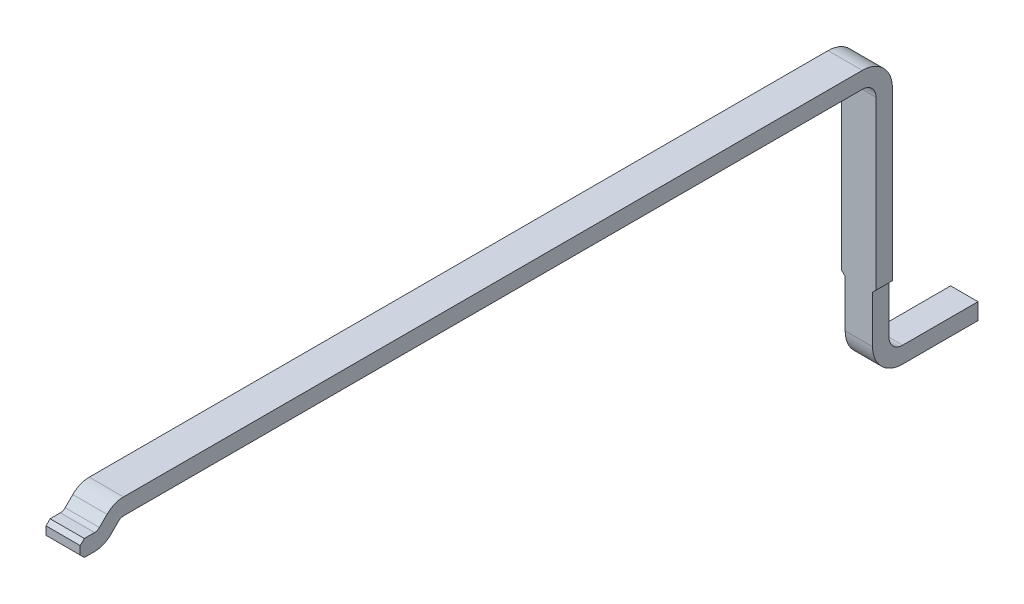
ISO-10303-21;
HEADER;
FILE_DESCRIPTION(('STEP AP214'),'2;1');
FILE_NAME('part.step','',(''),(''),'','','');
FILE_SCHEMA(('AUTOMOTIVE_DESIGN { 1 0 10303 214 1 1 1 1 }'));
ENDSEC;
DATA;
#1=APPLICATION_CONTEXT('core data for automotive mechanical design processes');
#2=APPLICATION_PROTOCOL_DEFINITION('international standard','automotive_design',2000,#1);
#3=PRODUCT_CONTEXT('',#1,'mechanical');
#4=PRODUCT('Part','Part','',(#3));
#5=PRODUCT_RELATED_PRODUCT_CATEGORY('part','',(#4));
#6=PRODUCT_DEFINITION_FORMATION('','',#4);
#7=PRODUCT_DEFINITION_CONTEXT('part definition',#1,'design');
#8=PRODUCT_DEFINITION('design','',#6,#7);
#9=PRODUCT_DEFINITION_SHAPE('','',#8);
#10=(LENGTH_UNIT() NAMED_UNIT(*) SI_UNIT(.MILLI.,.METRE.));
#11=(NAMED_UNIT(*) PLANE_ANGLE_UNIT() SI_UNIT($,.RADIAN.));
#12=(NAMED_UNIT(*) SI_UNIT($,.STERADIAN.) SOLID_ANGLE_UNIT());
#13=UNCERTAINTY_MEASURE_WITH_UNIT(LENGTH_MEASURE(1.E-05),#10,'distance_accuracy_value','');
#14=(GEOMETRIC_REPRESENTATION_CONTEXT(3) GLOBAL_UNCERTAINTY_ASSIGNED_CONTEXT((#13)) GLOBAL_UNIT_ASSIGNED_CONTEXT((#10,
#11,#12)) REPRESENTATION_CONTEXT('',''));
#15=CARTESIAN_POINT('',(0.,0.,0.));
#16=DIRECTION('',(0.,0.,1.));
#17=DIRECTION('',(1.,0.,0.));
#18=AXIS2_PLACEMENT_3D('',#15,#16,#17);
#19=CARTESIAN_POINT('',(12.5121082047,13.39951558355,-11.38169883308));
#20=DIRECTION('',(0.,1.,0.));
#21=DIRECTION('',(1.,0.,0.));
#22=AXIS2_PLACEMENT_3D('',#19,#20,#21);
#23=PLANE('',#22);
#24=DIRECTION('',(0.,0.,-1.));
#25=VECTOR('',#24,1.);
#26=CARTESIAN_POINT('',(15.91210822402,13.39951558355,-12.98169883308));
#27=LINE('',#26,#25);
#28=CARTESIAN_POINT('',(15.91210822402,13.39951558355,-5.777115138679));
#29=VERTEX_POINT('',#28);
#30=CARTESIAN_POINT('',(15.91210822402,13.39951558355,-11.17169883308));
#31=VERTEX_POINT('',#30);
#32=EDGE_CURVE('E422',#29,#31,#27,.T.);
#33=ORIENTED_EDGE('',*,*,#32,.F.);
#34=DIRECTION('',(1.,0.,0.));
#35=VECTOR('',#34,1.);
#36=CARTESIAN_POINT('',(12.5121082047,13.39951558355,-5.777115138679));
#37=LINE('',#36,#35);
#38=CARTESIAN_POINT('',(15.66210822402,13.39951558355,-5.777115138679));
#39=VERTEX_POINT('',#38);
#40=EDGE_CURVE('E316',#39,#29,#37,.T.);
#41=ORIENTED_EDGE('',*,*,#40,.F.);
#42=DIRECTION('',(0.,0.,1.));
#43=VECTOR('',#42,1.);
#44=CARTESIAN_POINT('',(15.66210822402,13.39951558355,-5.731698833076));
#45=LINE('',#44,#43);
#46=CARTESIAN_POINT('',(15.66210822402,13.39951558355,-11.17169883308));
#47=VERTEX_POINT('',#46);
#48=EDGE_CURVE('E288',#47,#39,#45,.T.);
#49=ORIENTED_EDGE('',*,*,#48,.F.);
#50=DIRECTION('',(1.,0.,0.));
#51=VECTOR('',#50,1.);
#52=CARTESIAN_POINT('',(13.11210817501,13.39951558355,-11.17169883308));
#53=LINE('',#52,#51);
#54=EDGE_CURVE('E319',#47,#31,#53,.T.);
#55=ORIENTED_EDGE('',*,*,#54,.T.);
#56=EDGE_LOOP('',(#33,#41,#49,#55));
#57=FACE_BOUND('',#56,.T.);
#58=ADVANCED_FACE('F17',(#57),#23,.F.);
#59=CARTESIAN_POINT('',(13.0621082047,13.51951558355,-7.369063364689));
#60=DIRECTION('',(0.,1.,0.));
#61=DIRECTION('',(1.,0.,0.));
#62=AXIS2_PLACEMENT_3D('',#59,#60,#61);
#63=PLANE('',#62);
#64=DIRECTION('',(-1.,0.,0.));
#65=VECTOR('',#64,1.);
#66=CARTESIAN_POINT('',(13.0621082047,13.51951558355,-11.17169883308));
#67=LINE('',#66,#65);
#68=CARTESIAN_POINT('',(15.91210822402,13.51951558355,-11.17169883308));
#69=VERTEX_POINT('',#68);
#70=CARTESIAN_POINT('',(15.66210822402,13.51951558355,-11.17169883308));
#71=VERTEX_POINT('',#70);
#72=EDGE_CURVE('E28',#69,#71,#67,.T.);
#73=ORIENTED_EDGE('',*,*,#72,.T.);
#74=DIRECTION('',(0.,0.,1.));
#75=VECTOR('',#74,1.);
#76=CARTESIAN_POINT('',(15.66210822402,13.51951558355,-7.369063364689));
#77=LINE('',#76,#75);
#78=CARTESIAN_POINT('',(15.66210822402,13.51951558355,-5.777115138679));
#79=VERTEX_POINT('',#78);
#80=EDGE_CURVE('E302',#71,#79,#77,.T.);
#81=ORIENTED_EDGE('',*,*,#80,.T.);
#82=DIRECTION('',(1.,0.,0.));
#83=VECTOR('',#82,1.);
#84=CARTESIAN_POINT('',(13.0621082047,13.51951558355,-5.777115138679));
#85=LINE('',#84,#83);
#86=CARTESIAN_POINT('',(15.91210822402,13.51951558355,-5.777115138679));
#87=VERTEX_POINT('',#86);
#88=EDGE_CURVE('E11',#79,#87,#85,.T.);
#89=ORIENTED_EDGE('',*,*,#88,.T.);
#90=DIRECTION('',(0.,0.,-1.));
#91=VECTOR('',#90,1.);
#92=CARTESIAN_POINT('',(15.91210822402,13.51951558355,-7.369063364689));
#93=LINE('',#92,#91);
#94=EDGE_CURVE('E325',#87,#69,#93,.T.);
#95=ORIENTED_EDGE('',*,*,#94,.T.);
#96=EDGE_LOOP('',(#73,#81,#89,#95));
#97=FACE_BOUND('',#96,.T.);
#98=ADVANCED_FACE('F584',(#97),#63,.T.);
#99=CARTESIAN_POINT('',(13.0621082047,13.34951558355,-5.777115138679));
#100=DIRECTION('',(-1.,0.,0.));
#101=DIRECTION('',(0.,0.,-1.));
#102=AXIS2_PLACEMENT_3D('',#99,#100,#101);
#103=CYLINDRICAL_SURFACE('',#102,0.17);
#104=ORIENTED_EDGE('',*,*,#88,.F.);
#105=CARTESIAN_POINT('',(15.66210822402,13.34951558355,-5.777115138679));
#106=DIRECTION('',(1.,0.,0.));
#107=DIRECTION('',(0.,0.,-1.));
#108=AXIS2_PLACEMENT_3D('',#105,#106,#107);
#109=CIRCLE('',#108,0.17);
#110=CARTESIAN_POINT('',(15.66210822402,13.469723736351,-5.656906985878));
#111=VERTEX_POINT('',#110);
#112=EDGE_CURVE('E298',#79,#111,#109,.T.);
#113=ORIENTED_EDGE('',*,*,#112,.T.);
#114=DIRECTION('',(1.,0.,0.));
#115=VECTOR('',#114,1.);
#116=CARTESIAN_POINT('',(13.0621082047,13.469723736351,-5.656906985877));
#117=LINE('',#116,#115);
#118=CARTESIAN_POINT('',(15.91210822402,13.469723736351,-5.656906985878));
#119=VERTEX_POINT('',#118);
#120=EDGE_CURVE('E359',#111,#119,#117,.T.);
#121=ORIENTED_EDGE('',*,*,#120,.T.);
#122=CARTESIAN_POINT('',(15.91210822402,13.34951558355,-5.777115138679));
#123=DIRECTION('',(1.,0.,0.));
#124=DIRECTION('',(0.,0.,-1.));
#125=AXIS2_PLACEMENT_3D('',#122,#123,#124);
#126=CIRCLE('',#125,0.17);
#127=EDGE_CURVE('E320',#87,#119,#126,.T.);
#128=ORIENTED_EDGE('',*,*,#127,.F.);
#129=EDGE_LOOP('',(#104,#113,#121,#128));
#130=FACE_BOUND('',#129,.T.);
#131=ADVANCED_FACE('F591',(#130),#103,.T.);
#132=CARTESIAN_POINT('',(13.1121082047,13.29951558355,-11.17169883308));
#133=DIRECTION('',(1.,0.,0.));
#134=DIRECTION('',(0.,0.,1.));
#135=AXIS2_PLACEMENT_3D('',#132,#133,#134);
#136=CYLINDRICAL_SURFACE('',#135,0.22);
#137=ORIENTED_EDGE('',*,*,#72,.F.);
#138=CARTESIAN_POINT('',(15.91210822402,13.29951558355,-11.17169883308));
#139=DIRECTION('',(-1.,0.,0.));
#140=DIRECTION('',(0.,0.,1.));
#141=AXIS2_PLACEMENT_3D('',#138,#139,#140);
#142=CIRCLE('',#141,0.22);
#143=CARTESIAN_POINT('',(15.91210822402,13.29951558355,-11.39169883308));
#144=VERTEX_POINT('',#143);
#145=EDGE_CURVE('E392',#69,#144,#142,.T.);
#146=ORIENTED_EDGE('',*,*,#145,.T.);
#147=DIRECTION('',(-1.,0.,0.));
#148=VECTOR('',#147,1.);
#149=CARTESIAN_POINT('',(13.1121082047,13.29951558355,-11.39169883308));
#150=LINE('',#149,#148);
#151=CARTESIAN_POINT('',(15.66210822402,13.29951558355,-11.39169883308));
#152=VERTEX_POINT('',#151);
#153=EDGE_CURVE('E358',#144,#152,#150,.T.);
#154=ORIENTED_EDGE('',*,*,#153,.T.);
#155=CARTESIAN_POINT('',(15.66210822402,13.29951558355,-11.17169883308));
#156=DIRECTION('',(1.,0.,0.));
#157=DIRECTION('',(0.,0.,1.));
#158=AXIS2_PLACEMENT_3D('',#155,#156,#157);
#159=CIRCLE('',#158,0.22);
#160=EDGE_CURVE('E508',#152,#71,#159,.T.);
#161=ORIENTED_EDGE('',*,*,#160,.T.);
#162=EDGE_LOOP('',(#137,#146,#154,#161));
#163=FACE_BOUND('',#162,.T.);
#164=ADVANCED_FACE('F596',(#163),#136,.T.);
#165=CARTESIAN_POINT('',(16.91210823377,13.39951558355,-5.586698833076));
#166=DIRECTION('',(0.,0.707106781186048,0.707106781187048));
#167=DIRECTION('',(1.,0.,0.));
#168=AXIS2_PLACEMENT_3D('',#165,#166,#167);
#169=PLANE('',#168);
#170=DIRECTION('',(1.,0.,0.));
#171=VECTOR('',#170,1.);
#172=CARTESIAN_POINT('',(16.91210823377,13.414160244491,-5.601343494016));
#173=LINE('',#172,#171);
#174=CARTESIAN_POINT('',(15.66210822402,13.41416024449,-5.601343494017));
#175=VERTEX_POINT('',#174);
#176=CARTESIAN_POINT('',(15.91210822402,13.41416024449,-5.601343494017));
#177=VERTEX_POINT('',#176);
#178=EDGE_CURVE('E178',#175,#177,#173,.T.);
#179=ORIENTED_EDGE('',*,*,#178,.T.);
#180=DIRECTION('',(0.,-0.707106781180048,0.707106781193047));
#181=VECTOR('',#180,1.);
#182=CARTESIAN_POINT('',(15.91210822402,13.46972373635,-5.656906985878));
#183=LINE('',#182,#181);
#184=EDGE_CURVE('E324',#119,#177,#183,.T.);
#185=ORIENTED_EDGE('',*,*,#184,.F.);
#186=ORIENTED_EDGE('',*,*,#120,.F.);
#187=DIRECTION('',(0.,-0.707106781180048,0.707106781193047));
#188=VECTOR('',#187,1.);
#189=CARTESIAN_POINT('',(15.66210822402,13.46972373635,-5.656906985878));
#190=LINE('',#189,#188);
#191=EDGE_CURVE('E303',#111,#175,#190,.T.);
#192=ORIENTED_EDGE('',*,*,#191,.T.);
#193=EDGE_LOOP('',(#179,#185,#186,#192));
#194=FACE_BOUND('',#193,.T.);
#195=ADVANCED_FACE('F640',(#194),#169,.T.);
#196=CARTESIAN_POINT('',(16.91210823377,13.44951558355,-5.565988154957));
#197=DIRECTION('',(-1.,0.,0.));
#198=DIRECTION('',(0.,0.,-1.));
#199=AXIS2_PLACEMENT_3D('',#196,#197,#198);
#200=CYLINDRICAL_SURFACE('',#199,0.05);
#201=DIRECTION('',(1.,0.,0.));
#202=VECTOR('',#201,1.);
#203=CARTESIAN_POINT('',(17.56534248199,13.39951558355,-5.565988154957));
#204=LINE('',#203,#202);
#205=CARTESIAN_POINT('',(15.66210822402,13.39951558355,-5.565988154957));
#206=VERTEX_POINT('',#205);
#207=CARTESIAN_POINT('',(15.91210822402,13.39951558355,-5.565988154957));
#208=VERTEX_POINT('',#207);
#209=EDGE_CURVE('E165',#206,#208,#204,.T.);
#210=ORIENTED_EDGE('',*,*,#209,.T.);
#211=CARTESIAN_POINT('',(15.91210822402,13.44951558355,-5.565988154957));
#212=DIRECTION('',(-1.,0.,0.));
#213=DIRECTION('',(0.,0.,-1.));
#214=AXIS2_PLACEMENT_3D('',#211,#212,#213);
#215=CIRCLE('',#214,0.05);
#216=EDGE_CURVE('E388',#177,#208,#215,.T.);
#217=ORIENTED_EDGE('',*,*,#216,.F.);
#218=ORIENTED_EDGE('',*,*,#178,.F.);
#219=CARTESIAN_POINT('',(15.66210822402,13.44951558355,-5.565988154957));
#220=DIRECTION('',(-1.,0.,0.));
#221=DIRECTION('',(0.,0.,-1.));
#222=AXIS2_PLACEMENT_3D('',#219,#220,#221);
#223=CIRCLE('',#222,0.05);
#224=EDGE_CURVE('E314',#175,#206,#223,.T.);
#225=ORIENTED_EDGE('',*,*,#224,.T.);
#226=EDGE_LOOP('',(#210,#217,#218,#225));
#227=FACE_BOUND('',#226,.T.);
#228=ADVANCED_FACE('F638',(#227),#200,.F.);
#229=CARTESIAN_POINT('',(17.56534248199,13.39951558355,-5.535988154957));
#230=DIRECTION('',(0.,-1.,-1.402976681707E-13));
#231=DIRECTION('',(0.,1.402976681707E-13,-1.));
#232=AXIS2_PLACEMENT_3D('',#229,#230,#231);
#233=PLANE('',#232);
#234=DIRECTION('',(0.,0.,1.));
#235=VECTOR('',#234,1.);
#236=CARTESIAN_POINT('',(15.91210822402,13.39951558355,-12.98169883308));
#237=LINE('',#236,#235);
#238=CARTESIAN_POINT('',(15.91210822402,13.39951558355,-5.491404460561));
#239=VERTEX_POINT('',#238);
#240=EDGE_CURVE('E384',#208,#239,#237,.T.);
#241=ORIENTED_EDGE('',*,*,#240,.F.);
#242=ORIENTED_EDGE('',*,*,#209,.F.);
#243=DIRECTION('',(0.,0.,1.));
#244=VECTOR('',#243,1.);
#245=CARTESIAN_POINT('',(15.66210822402,13.39951558355,-5.731698833076));
#246=LINE('',#245,#244);
#247=CARTESIAN_POINT('',(15.66210822402,13.39951558355,-5.491404460561));
#248=VERTEX_POINT('',#247);
#249=EDGE_CURVE('E310',#206,#248,#246,.T.);
#250=ORIENTED_EDGE('',*,*,#249,.T.);
#251=DIRECTION('',(-1.,0.,0.));
#252=VECTOR('',#251,1.);
#253=CARTESIAN_POINT('',(16.91210823377,13.39951558355,-5.491404460561));
#254=LINE('',#253,#252);
#255=EDGE_CURVE('E326',#239,#248,#254,.T.);
#256=ORIENTED_EDGE('',*,*,#255,.F.);
#257=EDGE_LOOP('',(#241,#242,#250,#256));
#258=FACE_BOUND('',#257,.T.);
#259=ADVANCED_FACE('F635',(#258),#233,.F.);
#260=CARTESIAN_POINT('',(16.91210823377,13.36951558355,-5.461404460561));
#261=DIRECTION('',(0.,0.707106781186048,0.707106781187048));
#262=DIRECTION('',(1.,0.,0.));
#263=AXIS2_PLACEMENT_3D('',#260,#261,#262);
#264=PLANE('',#263);
#265=DIRECTION('',(-1.,0.,0.));
#266=VECTOR('',#265,1.);
#267=CARTESIAN_POINT('',(16.91210823377,13.36951558355,-5.461404460561));
#268=LINE('',#267,#266);
#269=CARTESIAN_POINT('',(15.91210822402,13.36951558355,-5.461404460561));
#270=VERTEX_POINT('',#269);
#271=CARTESIAN_POINT('',(15.66210822402,13.36951558355,-5.461404460561));
#272=VERTEX_POINT('',#271);
#273=EDGE_CURVE('E329',#270,#272,#268,.T.);
#274=ORIENTED_EDGE('',*,*,#273,.F.);
#275=DIRECTION('',(0.,-0.707106781186548,0.707106781186548));
#276=VECTOR('',#275,1.);
#277=CARTESIAN_POINT('',(15.91210822402,13.39951558355,-5.491404460561));
#278=LINE('',#277,#276);
#279=EDGE_CURVE('E353',#239,#270,#278,.T.);
#280=ORIENTED_EDGE('',*,*,#279,.F.);
#281=ORIENTED_EDGE('',*,*,#255,.T.);
#282=DIRECTION('',(0.,-0.707106781186548,0.707106781186548));
#283=VECTOR('',#282,1.);
#284=CARTESIAN_POINT('',(15.66210822402,13.39951558355,-5.491404460561));
#285=LINE('',#284,#283);
#286=EDGE_CURVE('E315',#248,#272,#285,.T.);
#287=ORIENTED_EDGE('',*,*,#286,.T.);
#288=EDGE_LOOP('',(#274,#280,#281,#287));
#289=FACE_BOUND('',#288,.T.);
#290=ADVANCED_FACE('F623',(#289),#264,.T.);
#291=CARTESIAN_POINT('',(16.91210823377,13.27951558355,-5.461404460561));
#292=DIRECTION('',(0.,0.,1.));
#293=DIRECTION('',(1.,0.,0.));
#294=AXIS2_PLACEMENT_3D('',#291,#292,#293);
#295=PLANE('',#294);
#296=DIRECTION('',(1.,0.,0.));
#297=VECTOR('',#296,1.);
#298=CARTESIAN_POINT('',(16.91210823377,13.30951558355,-5.461404460561));
#299=LINE('',#298,#297);
#300=CARTESIAN_POINT('',(15.66210822402,13.30951558355,-5.461404460561));
#301=VERTEX_POINT('',#300);
#302=CARTESIAN_POINT('',(15.91210822402,13.30951558355,-5.461404460561));
#303=VERTEX_POINT('',#302);
#304=EDGE_CURVE('E464',#301,#303,#299,.T.);
#305=ORIENTED_EDGE('',*,*,#304,.T.);
#306=DIRECTION('',(0.,-1.,0.));
#307=VECTOR('',#306,1.);
#308=CARTESIAN_POINT('',(15.91210822402,13.67951558355,-5.461404460561));
#309=LINE('',#308,#307);
#310=EDGE_CURVE('E348',#270,#303,#309,.T.);
#311=ORIENTED_EDGE('',*,*,#310,.F.);
#312=ORIENTED_EDGE('',*,*,#273,.T.);
#313=DIRECTION('',(0.,-1.,0.));
#314=VECTOR('',#313,1.);
#315=CARTESIAN_POINT('',(15.66210822402,13.39951558355,-5.461404460561));
#316=LINE('',#315,#314);
#317=EDGE_CURVE('E339',#272,#301,#316,.T.);
#318=ORIENTED_EDGE('',*,*,#317,.T.);
#319=EDGE_LOOP('',(#305,#311,#312,#318));
#320=FACE_BOUND('',#319,.T.);
#321=ADVANCED_FACE('F602',(#320),#295,.T.);
#322=CARTESIAN_POINT('',(16.91210823377,13.27951558355,-5.491404460561));
#323=DIRECTION('',(0.,0.707106781186048,-0.707106781187048));
#324=DIRECTION('',(-1.,0.,0.));
#325=AXIS2_PLACEMENT_3D('',#322,#323,#324);
#326=PLANE('',#325);
#327=DIRECTION('',(-1.,0.,0.));
#328=VECTOR('',#327,1.);
#329=CARTESIAN_POINT('',(16.91210823377,13.27951558355,-5.491404460561));
#330=LINE('',#329,#328);
#331=CARTESIAN_POINT('',(15.91210822402,13.27951558355,-5.491404460561));
#332=VERTEX_POINT('',#331);
#333=CARTESIAN_POINT('',(15.66210822402,13.27951558355,-5.491404460561));
#334=VERTEX_POINT('',#333);
#335=EDGE_CURVE('E458',#332,#334,#330,.T.);
#336=ORIENTED_EDGE('',*,*,#335,.F.);
#337=DIRECTION('',(0.,-0.707106781186548,-0.707106781186548));
#338=VECTOR('',#337,1.);
#339=CARTESIAN_POINT('',(15.91210822402,13.30951558355,-5.461404460561));
#340=LINE('',#339,#338);
#341=EDGE_CURVE('E352',#303,#332,#340,.T.);
#342=ORIENTED_EDGE('',*,*,#341,.F.);
#343=ORIENTED_EDGE('',*,*,#304,.F.);
#344=DIRECTION('',(0.,-0.707106781186548,-0.707106781186548));
#345=VECTOR('',#344,1.);
#346=CARTESIAN_POINT('',(15.66210822402,13.30951558355,-5.461404460561));
#347=LINE('',#346,#345);
#348=EDGE_CURVE('E335',#301,#334,#347,.T.);
#349=ORIENTED_EDGE('',*,*,#348,.T.);
#350=EDGE_LOOP('',(#336,#342,#343,#349));
#351=FACE_BOUND('',#350,.T.);
#352=ADVANCED_FACE('F598',(#351),#326,.F.);
#353=CARTESIAN_POINT('',(16.91210823377,13.27951558355,-5.661404460561));
#354=DIRECTION('',(0.,-1.,0.));
#355=DIRECTION('',(0.,0.,-1.));
#356=AXIS2_PLACEMENT_3D('',#353,#354,#355);
#357=PLANE('',#356);
#358=ORIENTED_EDGE('',*,*,#335,.T.);
#359=DIRECTION('',(0.,0.,-1.));
#360=VECTOR('',#359,1.);
#361=CARTESIAN_POINT('',(15.66210822402,13.27951558355,-5.731698833076));
#362=LINE('',#361,#360);
#363=CARTESIAN_POINT('',(15.66210822402,13.27951558355,-5.565988154957));
#364=VERTEX_POINT('',#363);
#365=EDGE_CURVE('E276',#334,#364,#362,.T.);
#366=ORIENTED_EDGE('',*,*,#365,.T.);
#367=DIRECTION('',(-1.,0.,0.));
#368=VECTOR('',#367,1.);
#369=CARTESIAN_POINT('',(16.91210823377,13.27951558355,-5.565988154957));
#370=LINE('',#369,#368);
#371=CARTESIAN_POINT('',(15.91210822402,13.27951558355,-5.565988154957));
#372=VERTEX_POINT('',#371);
#373=EDGE_CURVE('E266',#372,#364,#370,.T.);
#374=ORIENTED_EDGE('',*,*,#373,.F.);
#375=DIRECTION('',(0.,0.,-1.));
#376=VECTOR('',#375,1.);
#377=CARTESIAN_POINT('',(15.91210822402,13.27951558355,-12.98169883308));
#378=LINE('',#377,#376);
#379=EDGE_CURVE('E401',#332,#372,#378,.T.);
#380=ORIENTED_EDGE('',*,*,#379,.F.);
#381=EDGE_LOOP('',(#358,#366,#374,#380));
#382=FACE_BOUND('',#381,.T.);
#383=ADVANCED_FACE('F601',(#382),#357,.T.);
#384=CARTESIAN_POINT('',(16.91210823377,13.44951558355,-5.565988154957));
#385=DIRECTION('',(1.,0.,0.));
#386=DIRECTION('',(0.,0.,1.));
#387=AXIS2_PLACEMENT_3D('',#384,#385,#386);
#388=CYLINDRICAL_SURFACE('',#387,0.17);
#389=DIRECTION('',(-1.,0.,0.));
#390=VECTOR('',#389,1.);
#391=CARTESIAN_POINT('',(16.91210823377,13.329307430749,-5.68619630776));
#392=LINE('',#391,#390);
#393=CARTESIAN_POINT('',(15.91210822402,13.329307430749,-5.686196307759));
#394=VERTEX_POINT('',#393);
#395=CARTESIAN_POINT('',(15.66210822402,13.329307430749,-5.686196307759));
#396=VERTEX_POINT('',#395);
#397=EDGE_CURVE('E254',#394,#396,#392,.T.);
#398=ORIENTED_EDGE('',*,*,#397,.F.);
#399=CARTESIAN_POINT('',(15.91210822402,13.44951558355,-5.565988154957));
#400=DIRECTION('',(1.,0.,0.));
#401=DIRECTION('',(0.,0.,1.));
#402=AXIS2_PLACEMENT_3D('',#399,#400,#401);
#403=CIRCLE('',#402,0.17);
#404=EDGE_CURVE('E21',#372,#394,#403,.T.);
#405=ORIENTED_EDGE('',*,*,#404,.F.);
#406=ORIENTED_EDGE('',*,*,#373,.T.);
#407=CARTESIAN_POINT('',(15.66210822402,13.44951558355,-5.565988154957));
#408=DIRECTION('',(1.,0.,0.));
#409=DIRECTION('',(0.,0.,1.));
#410=AXIS2_PLACEMENT_3D('',#407,#408,#409);
#411=CIRCLE('',#410,0.17);
#412=EDGE_CURVE('E270',#364,#396,#411,.T.);
#413=ORIENTED_EDGE('',*,*,#412,.T.);
#414=EDGE_LOOP('',(#398,#405,#406,#413));
#415=FACE_BOUND('',#414,.T.);
#416=ADVANCED_FACE('F271',(#415),#388,.T.);
#417=CARTESIAN_POINT('',(16.91210823377,13.39951558355,-5.756404460561));
#418=DIRECTION('',(0.,-0.707106781187048,-0.707106781186048));
#419=DIRECTION('',(0.,0.707106781186048,-0.707106781187048));
#420=AXIS2_PLACEMENT_3D('',#417,#418,#419);
#421=PLANE('',#420);
#422=DIRECTION('',(1.,0.,0.));
#423=VECTOR('',#422,1.);
#424=CARTESIAN_POINT('',(12.5121082047,13.38487092261,-5.74175979962));
#425=LINE('',#424,#423);
#426=CARTESIAN_POINT('',(15.66210822402,13.38487092261,-5.74175979962));
#427=VERTEX_POINT('',#426);
#428=CARTESIAN_POINT('',(15.91210822402,13.38487092261,-5.74175979962));
#429=VERTEX_POINT('',#428);
#430=EDGE_CURVE('E267',#427,#429,#425,.T.);
#431=ORIENTED_EDGE('',*,*,#430,.T.);
#432=DIRECTION('',(0.,0.707106781180048,-0.707106781193047));
#433=VECTOR('',#432,1.);
#434=CARTESIAN_POINT('',(15.91210822402,13.32930743075,-5.686196307759));
#435=LINE('',#434,#433);
#436=EDGE_CURVE('E261',#394,#429,#435,.T.);
#437=ORIENTED_EDGE('',*,*,#436,.F.);
#438=ORIENTED_EDGE('',*,*,#397,.T.);
#439=DIRECTION('',(0.,0.707106781180048,-0.707106781193047));
#440=VECTOR('',#439,1.);
#441=CARTESIAN_POINT('',(15.66210822402,13.32930743075,-5.686196307759));
#442=LINE('',#441,#440);
#443=EDGE_CURVE('E258',#396,#427,#442,.T.);
#444=ORIENTED_EDGE('',*,*,#443,.T.);
#445=EDGE_LOOP('',(#431,#437,#438,#444));
#446=FACE_BOUND('',#445,.T.);
#447=ADVANCED_FACE('F256',(#446),#421,.T.);
#448=CARTESIAN_POINT('',(12.5121082047,13.34951558355,-5.777115138679));
#449=DIRECTION('',(1.,0.,0.));
#450=DIRECTION('',(0.,0.,1.));
#451=AXIS2_PLACEMENT_3D('',#448,#449,#450);
#452=CYLINDRICAL_SURFACE('',#451,0.05);
#453=ORIENTED_EDGE('',*,*,#40,.T.);
#454=CARTESIAN_POINT('',(15.91210822402,13.34951558355,-5.777115138679));
#455=DIRECTION('',(-1.,0.,0.));
#456=DIRECTION('',(0.,0.,1.));
#457=AXIS2_PLACEMENT_3D('',#454,#455,#456);
#458=CIRCLE('',#457,0.05);
#459=EDGE_CURVE('E343',#429,#29,#458,.T.);
#460=ORIENTED_EDGE('',*,*,#459,.F.);
#461=ORIENTED_EDGE('',*,*,#430,.F.);
#462=CARTESIAN_POINT('',(15.66210822402,13.34951558355,-5.777115138679));
#463=DIRECTION('',(-1.,0.,0.));
#464=DIRECTION('',(0.,0.,1.));
#465=AXIS2_PLACEMENT_3D('',#462,#463,#464);
#466=CIRCLE('',#465,0.05);
#467=EDGE_CURVE('E281',#427,#39,#466,.T.);
#468=ORIENTED_EDGE('',*,*,#467,.T.);
#469=EDGE_LOOP('',(#453,#460,#461,#468));
#470=FACE_BOUND('',#469,.T.);
#471=ADVANCED_FACE('F441',(#470),#452,.F.);
#472=CARTESIAN_POINT('',(12.5121082047,13.29951558355,-11.17169883308));
#473=DIRECTION('',(-1.,0.,0.));
#474=DIRECTION('',(0.,0.,-1.));
#475=AXIS2_PLACEMENT_3D('',#472,#473,#474);
#476=CYLINDRICAL_SURFACE('',#475,0.1);
#477=CARTESIAN_POINT('',(15.66210822402,13.29951558355,-11.17169883308));
#478=DIRECTION('',(1.,0.,0.));
#479=DIRECTION('',(0.,0.,-1.));
#480=AXIS2_PLACEMENT_3D('',#477,#478,#479);
#481=CIRCLE('',#480,0.1);
#482=CARTESIAN_POINT('',(15.66210822402,13.29951558355,-11.27169883308));
#483=VERTEX_POINT('',#482);
#484=EDGE_CURVE('E511',#483,#47,#481,.T.);
#485=ORIENTED_EDGE('',*,*,#484,.F.);
#486=DIRECTION('',(-1.,0.,0.));
#487=VECTOR('',#486,1.);
#488=CARTESIAN_POINT('',(12.5121082047,13.29951558355,-11.27169883308));
#489=LINE('',#488,#487);
#490=CARTESIAN_POINT('',(15.91210822402,13.29951558355,-11.27169883308));
#491=VERTEX_POINT('',#490);
#492=EDGE_CURVE('E342',#491,#483,#489,.T.);
#493=ORIENTED_EDGE('',*,*,#492,.F.);
#494=CARTESIAN_POINT('',(15.91210822402,13.29951558355,-11.17169883308));
#495=DIRECTION('',(-1.,0.,0.));
#496=DIRECTION('',(0.,0.,-1.));
#497=AXIS2_PLACEMENT_3D('',#494,#495,#496);
#498=CIRCLE('',#497,0.1);
#499=EDGE_CURVE('E428',#31,#491,#498,.T.);
#500=ORIENTED_EDGE('',*,*,#499,.F.);
#501=ORIENTED_EDGE('',*,*,#54,.F.);
#502=EDGE_LOOP('',(#485,#493,#500,#501));
#503=FACE_BOUND('',#502,.T.);
#504=ADVANCED_FACE('F580',(#503),#476,.F.);
#505=CARTESIAN_POINT('',(13.1121082047,11.34951558355,-11.27169883308));
#506=DIRECTION('',(0.,0.,1.));
#507=DIRECTION('',(1.,0.,0.));
#508=AXIS2_PLACEMENT_3D('',#505,#506,#507);
#509=PLANE('',#508);
#510=ORIENTED_EDGE('',*,*,#492,.T.);
#511=DIRECTION('',(0.,-1.,0.));
#512=VECTOR('',#511,1.);
#513=CARTESIAN_POINT('',(15.66210822402,13.39951558355,-11.27169883308));
#514=LINE('',#513,#512);
#515=CARTESIAN_POINT('',(15.66210822402,12.07951558355,-11.27169883308));
#516=VERTEX_POINT('',#515);
#517=EDGE_CURVE('E418',#483,#516,#514,.T.);
#518=ORIENTED_EDGE('',*,*,#517,.T.);
#519=DIRECTION('',(0.70710655010401,-0.70710701226901,0.));
#520=VECTOR('',#519,1.);
#521=CARTESIAN_POINT('',(15.66210822402,12.07951558355,-11.27169883308));
#522=LINE('',#521,#520);
#523=CARTESIAN_POINT('',(15.687108209283,12.0545155899837,-11.27169883308));
#524=VERTEX_POINT('',#523);
#525=EDGE_CURVE('E489',#516,#524,#522,.T.);
#526=ORIENTED_EDGE('',*,*,#525,.T.);
#527=DIRECTION('',(0.,-1.,0.));
#528=VECTOR('',#527,1.);
#529=CARTESIAN_POINT('',(15.68710820768,11.34951558355,-11.27169883308));
#530=LINE('',#529,#528);
#531=CARTESIAN_POINT('',(15.6871082153655,11.70951558355,-11.27169883308));
#532=VERTEX_POINT('',#531);
#533=EDGE_CURVE('E294',#524,#532,#530,.T.);
#534=ORIENTED_EDGE('',*,*,#533,.T.);
#535=DIRECTION('',(1.,0.,0.));
#536=VECTOR('',#535,1.);
#537=CARTESIAN_POINT('',(13.1121082047,11.70951558355,-11.27169883308));
#538=LINE('',#537,#536);
#539=CARTESIAN_POINT('',(15.8871081992252,11.70951558355,-11.27169883308));
#540=VERTEX_POINT('',#539);
#541=EDGE_CURVE('E364',#532,#540,#538,.T.);
#542=ORIENTED_EDGE('',*,*,#541,.T.);
#543=DIRECTION('',(0.,1.,0.));
#544=VECTOR('',#543,1.);
#545=CARTESIAN_POINT('',(15.88710820768,11.34951558355,-11.27169883308));
#546=LINE('',#545,#544);
#547=CARTESIAN_POINT('',(15.8871082119855,12.0545155733364,-11.27169883308));
#548=VERTEX_POINT('',#547);
#549=EDGE_CURVE('E426',#540,#548,#546,.T.);
#550=ORIENTED_EDGE('',*,*,#549,.T.);
#551=DIRECTION('',(-0.707106781186048,-0.707106781187048,0.));
#552=VECTOR('',#551,1.);
#553=CARTESIAN_POINT('',(15.91210822402,12.07951558355,-11.27169883308));
#554=LINE('',#553,#552);
#555=CARTESIAN_POINT('',(15.91210822402,12.07951558355,-11.27169883308));
#556=VERTEX_POINT('',#555);
#557=EDGE_CURVE('E357',#556,#548,#554,.T.);
#558=ORIENTED_EDGE('',*,*,#557,.F.);
#559=DIRECTION('',(0.,-1.,0.));
#560=VECTOR('',#559,1.);
#561=CARTESIAN_POINT('',(15.91210822402,13.67951558355,-11.27169883308));
#562=LINE('',#561,#560);
#563=EDGE_CURVE('E414',#491,#556,#562,.T.);
#564=ORIENTED_EDGE('',*,*,#563,.F.);
#565=EDGE_LOOP('',(#510,#518,#526,#534,#542,#550,#558,#564));
#566=FACE_BOUND('',#565,.T.);
#567=ADVANCED_FACE('F563',(#566),#509,.T.);
#568=CARTESIAN_POINT('',(15.91210822402,12.07951558355,-12.98169883308));
#569=DIRECTION('',(0.707106781187048,-0.707106781186048,0.));
#570=DIRECTION('',(0.,0.,-1.));
#571=AXIS2_PLACEMENT_3D('',#568,#569,#570);
#572=PLANE('',#571);
#573=DIRECTION('',(0.,0.,-1.));
#574=VECTOR('',#573,1.);
#575=CARTESIAN_POINT('',(15.91210822402,12.07951558355,-12.98169883308));
#576=LINE('',#575,#574);
#577=CARTESIAN_POINT('',(15.91210822402,12.07951558355,-11.39169883308));
#578=VERTEX_POINT('',#577);
#579=EDGE_CURVE('E400',#556,#578,#576,.T.);
#580=ORIENTED_EDGE('',*,*,#579,.F.);
#581=ORIENTED_EDGE('',*,*,#557,.T.);
#582=DIRECTION('',(0.,0.,-1.));
#583=VECTOR('',#582,1.);
#584=CARTESIAN_POINT('',(15.88710821585,12.05451557538,-12.98169883308));
#585=LINE('',#584,#583);
#586=CARTESIAN_POINT('',(15.887108209283,12.0545155771163,-11.39169883308));
#587=VERTEX_POINT('',#586);
#588=EDGE_CURVE('E455',#548,#587,#585,.T.);
#589=ORIENTED_EDGE('',*,*,#588,.T.);
#590=DIRECTION('',(0.70710701226901,0.70710655010401,0.));
#591=VECTOR('',#590,1.);
#592=CARTESIAN_POINT('',(15.88710820768,12.05451558355,-11.39169883308));
#593=LINE('',#592,#591);
#594=EDGE_CURVE('E354',#587,#578,#593,.T.);
#595=ORIENTED_EDGE('',*,*,#594,.T.);
#596=EDGE_LOOP('',(#580,#581,#589,#595));
#597=FACE_BOUND('',#596,.T.);
#598=ADVANCED_FACE('F558',(#597),#572,.T.);
#599=CARTESIAN_POINT('',(13.1121082047,13.51951558355,-11.39169883308));
#600=DIRECTION('',(0.,0.,1.));
#601=DIRECTION('',(1.,0.,0.));
#602=AXIS2_PLACEMENT_3D('',#599,#600,#601);
#603=PLANE('',#602);
#604=DIRECTION('',(0.70710655010401,-0.70710701226901,0.));
#605=VECTOR('',#604,1.);
#606=CARTESIAN_POINT('',(15.66210822402,12.07951558355,-11.39169883308));
#607=LINE('',#606,#605);
#608=CARTESIAN_POINT('',(15.66210822402,12.07951558355,-11.39169883308));
#609=VERTEX_POINT('',#608);
#610=CARTESIAN_POINT('',(15.687108209283,12.0545155899837,-11.39169883308));
#611=VERTEX_POINT('',#610);
#612=EDGE_CURVE('E42',#609,#611,#607,.T.);
#613=ORIENTED_EDGE('',*,*,#612,.F.);
#614=DIRECTION('',(0.,1.,0.));
#615=VECTOR('',#614,1.);
#616=CARTESIAN_POINT('',(15.66210822402,13.39951558355,-11.39169883308));
#617=LINE('',#616,#615);
#618=EDGE_CURVE('E504',#609,#152,#617,.T.);
#619=ORIENTED_EDGE('',*,*,#618,.T.);
#620=ORIENTED_EDGE('',*,*,#153,.F.);
#621=DIRECTION('',(0.,1.,0.));
#622=VECTOR('',#621,1.);
#623=CARTESIAN_POINT('',(15.91210822402,13.67951558355,-11.39169883308));
#624=LINE('',#623,#622);
#625=EDGE_CURVE('E396',#578,#144,#624,.T.);
#626=ORIENTED_EDGE('',*,*,#625,.F.);
#627=ORIENTED_EDGE('',*,*,#594,.F.);
#628=DIRECTION('',(0.,1.,0.));
#629=VECTOR('',#628,1.);
#630=CARTESIAN_POINT('',(15.88710820768,13.51951558355,-11.39169883308));
#631=LINE('',#630,#629);
#632=CARTESIAN_POINT('',(15.8871081992252,11.70951558355,-11.39169883308));
#633=VERTEX_POINT('',#632);
#634=EDGE_CURVE('E367',#633,#587,#631,.T.);
#635=ORIENTED_EDGE('',*,*,#634,.F.);
#636=DIRECTION('',(1.,0.,0.));
#637=VECTOR('',#636,1.);
#638=CARTESIAN_POINT('',(13.1121082047,11.70951558355,-11.39169883308));
#639=LINE('',#638,#637);
#640=CARTESIAN_POINT('',(15.6871082073003,11.70951558355,-11.39169883308));
#641=VERTEX_POINT('',#640);
#642=EDGE_CURVE('E432',#641,#633,#639,.T.);
#643=ORIENTED_EDGE('',*,*,#642,.F.);
#644=DIRECTION('',(0.,-1.,0.));
#645=VECTOR('',#644,1.);
#646=CARTESIAN_POINT('',(15.68710820768,13.51951558355,-11.39169883308));
#647=LINE('',#646,#645);
#648=EDGE_CURVE('E297',#611,#641,#647,.T.);
#649=ORIENTED_EDGE('',*,*,#648,.F.);
#650=EDGE_LOOP('',(#613,#619,#620,#626,#627,#635,#643,#649));
#651=FACE_BOUND('',#650,.T.);
#652=ADVANCED_FACE('F570',(#651),#603,.F.);
#653=CARTESIAN_POINT('',(15.66210822402,12.07951558355,-5.731698833076));
#654=DIRECTION('',(0.707106781187048,0.707106781186048,0.));
#655=DIRECTION('',(0.,0.,-1.));
#656=AXIS2_PLACEMENT_3D('',#653,#654,#655);
#657=PLANE('',#656);
#658=ORIENTED_EDGE('',*,*,#612,.T.);
#659=DIRECTION('',(0.,0.,-1.));
#660=VECTOR('',#659,1.);
#661=CARTESIAN_POINT('',(15.68710821585,12.05451559172,-5.731698833076));
#662=LINE('',#661,#660);
#663=EDGE_CURVE('E512',#524,#611,#662,.T.);
#664=ORIENTED_EDGE('',*,*,#663,.F.);
#665=ORIENTED_EDGE('',*,*,#525,.F.);
#666=DIRECTION('',(0.,0.,-1.));
#667=VECTOR('',#666,1.);
#668=CARTESIAN_POINT('',(15.66210822402,12.07951558355,-5.731698833076));
#669=LINE('',#668,#667);
#670=EDGE_CURVE('E423',#516,#609,#669,.T.);
#671=ORIENTED_EDGE('',*,*,#670,.T.);
#672=EDGE_LOOP('',(#658,#664,#665,#671));
#673=FACE_BOUND('',#672,.T.);
#674=ADVANCED_FACE('F629',(#673),#657,.F.);
#675=CARTESIAN_POINT('',(15.68710817501,11.72951558355,-13.03169883308));
#676=DIRECTION('',(-1.,0.,0.));
#677=DIRECTION('',(0.,1.,0.));
#678=AXIS2_PLACEMENT_3D('',#675,#676,#677);
#679=PLANE('',#678);
#680=ORIENTED_EDGE('',*,*,#663,.T.);
#681=ORIENTED_EDGE('',*,*,#648,.T.);
#682=CARTESIAN_POINT('',(15.68710820768,11.70951558355,-11.49169883308));
#683=DIRECTION('',(1.,0.,0.));
#684=DIRECTION('',(0.,0.,1.));
#685=AXIS2_PLACEMENT_3D('',#682,#683,#684);
#686=CIRCLE('',#685,0.1);
#687=CARTESIAN_POINT('',(15.687108191161,11.60951558355,-11.49169883308));
#688=VERTEX_POINT('',#687);
#689=EDGE_CURVE('E308',#641,#688,#686,.T.);
#690=ORIENTED_EDGE('',*,*,#689,.T.);
#691=DIRECTION('',(0.,0.,-1.));
#692=VECTOR('',#691,1.);
#693=CARTESIAN_POINT('',(15.68710817501,11.60951558355,-13.03169883308));
#694=LINE('',#693,#692);
#695=CARTESIAN_POINT('',(15.68710817501,11.60951558355,-12.04169883308));
#696=VERTEX_POINT('',#695);
#697=EDGE_CURVE('E333',#688,#696,#694,.T.);
#698=ORIENTED_EDGE('',*,*,#697,.T.);
#699=DIRECTION('',(0.,-1.,0.));
#700=VECTOR('',#699,1.);
#701=CARTESIAN_POINT('',(15.68710817501,11.72951558355,-12.04169883308));
#702=LINE('',#701,#700);
#703=CARTESIAN_POINT('',(15.68710817501,11.48951558355,-12.04169883308));
#704=VERTEX_POINT('',#703);
#705=EDGE_CURVE('E522',#696,#704,#702,.T.);
#706=ORIENTED_EDGE('',*,*,#705,.T.);
#707=DIRECTION('',(0.,0.,1.));
#708=VECTOR('',#707,1.);
#709=CARTESIAN_POINT('',(15.68710817501,11.48951558355,-13.03169883308));
#710=LINE('',#709,#708);
#711=CARTESIAN_POINT('',(15.6871081992302,11.48951558355,-11.49169883308));
#712=VERTEX_POINT('',#711);
#713=EDGE_CURVE('E409',#704,#712,#710,.T.);
#714=ORIENTED_EDGE('',*,*,#713,.T.);
#715=CARTESIAN_POINT('',(15.68710822402,11.70951558355,-11.49169883308));
#716=DIRECTION('',(-1.,0.,0.));
#717=DIRECTION('',(0.,0.,-1.));
#718=AXIS2_PLACEMENT_3D('',#715,#716,#717);
#719=CIRCLE('',#718,0.22);
#720=EDGE_CURVE('E366',#712,#532,#719,.T.);
#721=ORIENTED_EDGE('',*,*,#720,.T.);
#722=ORIENTED_EDGE('',*,*,#533,.F.);
#723=EDGE_LOOP('',(#680,#681,#690,#698,#706,#714,#721,#722));
#724=FACE_BOUND('',#723,.T.);
#725=ADVANCED_FACE('F645',(#724),#679,.T.);
#726=CARTESIAN_POINT('',(13.1121082047,11.70951558355,-11.49169883308));
#727=DIRECTION('',(-1.,0.,0.));
#728=DIRECTION('',(0.,0.,-1.));
#729=AXIS2_PLACEMENT_3D('',#726,#727,#728);
#730=CYLINDRICAL_SURFACE('',#729,0.22);
#731=DIRECTION('',(1.,0.,0.));
#732=VECTOR('',#731,1.);
#733=CARTESIAN_POINT('',(13.1121082047,11.48951558355,-11.49169883308));
#734=LINE('',#733,#732);
#735=CARTESIAN_POINT('',(15.8871081829323,11.48951558355,-11.49169883308));
#736=VERTEX_POINT('',#735);
#737=EDGE_CURVE('E405',#712,#736,#734,.T.);
#738=ORIENTED_EDGE('',*,*,#737,.T.);
#739=CARTESIAN_POINT('',(15.88710819134,11.70951558355,-11.49169883308));
#740=DIRECTION('',(1.,0.,0.));
#741=DIRECTION('',(0.,0.,-1.));
#742=AXIS2_PLACEMENT_3D('',#739,#740,#741);
#743=CIRCLE('',#742,0.22);
#744=EDGE_CURVE('E424',#540,#736,#743,.T.);
#745=ORIENTED_EDGE('',*,*,#744,.F.);
#746=ORIENTED_EDGE('',*,*,#541,.F.);
#747=ORIENTED_EDGE('',*,*,#720,.F.);
#748=EDGE_LOOP('',(#738,#745,#746,#747));
#749=FACE_BOUND('',#748,.T.);
#750=ADVANCED_FACE('F620',(#749),#730,.T.);
#751=CARTESIAN_POINT('',(15.88710817501,11.72951558355,-13.03169883308));
#752=DIRECTION('',(1.,0.,0.));
#753=DIRECTION('',(0.,0.,-1.));
#754=AXIS2_PLACEMENT_3D('',#751,#752,#753);
#755=PLANE('',#754);
#756=ORIENTED_EDGE('',*,*,#588,.F.);
#757=ORIENTED_EDGE('',*,*,#549,.F.);
#758=ORIENTED_EDGE('',*,*,#744,.T.);
#759=DIRECTION('',(0.,0.,-1.));
#760=VECTOR('',#759,1.);
#761=CARTESIAN_POINT('',(15.88710817501,11.48951558355,-13.03169883308));
#762=LINE('',#761,#760);
#763=CARTESIAN_POINT('',(15.88710817501,11.48951558355,-12.04169883308));
#764=VERTEX_POINT('',#763);
#765=EDGE_CURVE('E410',#736,#764,#762,.T.);
#766=ORIENTED_EDGE('',*,*,#765,.T.);
#767=DIRECTION('',(0.,1.,0.));
#768=VECTOR('',#767,1.);
#769=CARTESIAN_POINT('',(15.88710817501,11.72951558355,-12.04169883308));
#770=LINE('',#769,#768);
#771=CARTESIAN_POINT('',(15.88710817501,11.60951558355,-12.04169883308));
#772=VERTEX_POINT('',#771);
#773=EDGE_CURVE('E330',#764,#772,#770,.T.);
#774=ORIENTED_EDGE('',*,*,#773,.T.);
#775=DIRECTION('',(0.,0.,1.));
#776=VECTOR('',#775,1.);
#777=CARTESIAN_POINT('',(15.88710817501,11.60951558355,-13.03169883308));
#778=LINE('',#777,#776);
#779=CARTESIAN_POINT('',(15.8871081829323,11.60951558355,-11.49169883308));
#780=VERTEX_POINT('',#779);
#781=EDGE_CURVE('E304',#772,#780,#778,.T.);
#782=ORIENTED_EDGE('',*,*,#781,.T.);
#783=CARTESIAN_POINT('',(15.88710819134,11.70951558355,-11.49169883308));
#784=DIRECTION('',(-1.,0.,0.));
#785=DIRECTION('',(0.,0.,1.));
#786=AXIS2_PLACEMENT_3D('',#783,#784,#785);
#787=CIRCLE('',#786,0.1);
#788=EDGE_CURVE('E435',#780,#633,#787,.T.);
#789=ORIENTED_EDGE('',*,*,#788,.T.);
#790=ORIENTED_EDGE('',*,*,#634,.T.);
#791=EDGE_LOOP('',(#756,#757,#758,#766,#774,#782,#789,#790));
#792=FACE_BOUND('',#791,.T.);
#793=ADVANCED_FACE('F567',(#792),#755,.T.);
#794=CARTESIAN_POINT('',(13.1121082047,11.70951558355,-11.49169883308));
#795=DIRECTION('',(1.,0.,0.));
#796=DIRECTION('',(0.,0.,1.));
#797=AXIS2_PLACEMENT_3D('',#794,#795,#796);
#798=CYLINDRICAL_SURFACE('',#797,0.1);
#799=ORIENTED_EDGE('',*,*,#689,.F.);
#800=ORIENTED_EDGE('',*,*,#642,.T.);
#801=ORIENTED_EDGE('',*,*,#788,.F.);
#802=DIRECTION('',(1.,0.,0.));
#803=VECTOR('',#802,1.);
#804=CARTESIAN_POINT('',(13.1121082047,11.60951558355,-11.49169883308));
#805=LINE('',#804,#803);
#806=EDGE_CURVE('E309',#688,#780,#805,.T.);
#807=ORIENTED_EDGE('',*,*,#806,.F.);
#808=EDGE_LOOP('',(#799,#800,#801,#807));
#809=FACE_BOUND('',#808,.T.);
#810=ADVANCED_FACE('F617',(#809),#798,.F.);
#811=CARTESIAN_POINT('',(12.58710817501,11.60951558355,-12.91169883308));
#812=DIRECTION('',(0.,1.,0.));
#813=DIRECTION('',(1.,0.,0.));
#814=AXIS2_PLACEMENT_3D('',#811,#812,#813);
#815=PLANE('',#814);
#816=DIRECTION('',(1.,0.,0.));
#817=VECTOR('',#816,1.);
#818=CARTESIAN_POINT('',(-1.819891462595,11.60951558355,-12.04169883308));
#819=LINE('',#818,#817);
#820=EDGE_CURVE('E292',#696,#772,#819,.T.);
#821=ORIENTED_EDGE('',*,*,#820,.F.);
#822=ORIENTED_EDGE('',*,*,#697,.F.);
#823=ORIENTED_EDGE('',*,*,#806,.T.);
#824=ORIENTED_EDGE('',*,*,#781,.F.);
#825=EDGE_LOOP('',(#821,#822,#823,#824));
#826=FACE_BOUND('',#825,.T.);
#827=ADVANCED_FACE('F613',(#826),#815,.T.);
#828=CARTESIAN_POINT('',(-1.819891462595,3.642432647913,-12.04169883308));
#829=DIRECTION('',(0.,0.,-1.));
#830=DIRECTION('',(-1.,0.,0.));
#831=AXIS2_PLACEMENT_3D('',#828,#829,#830);
#832=PLANE('',#831);
#833=ORIENTED_EDGE('',*,*,#705,.F.);
#834=ORIENTED_EDGE('',*,*,#820,.T.);
#835=ORIENTED_EDGE('',*,*,#773,.F.);
#836=DIRECTION('',(1.,0.,0.));
#837=VECTOR('',#836,1.);
#838=CARTESIAN_POINT('',(12.58710817501,11.48951558355,-12.04169883308));
#839=LINE('',#838,#837);
#840=EDGE_CURVE('E347',#704,#764,#839,.T.);
#841=ORIENTED_EDGE('',*,*,#840,.F.);
#842=EDGE_LOOP('',(#833,#834,#835,#841));
#843=FACE_BOUND('',#842,.T.);
#844=ADVANCED_FACE('F610',(#843),#832,.T.);
#845=CARTESIAN_POINT('',(12.58710817501,11.48951558355,-11.91169883308));
#846=DIRECTION('',(0.,-1.,0.));
#847=DIRECTION('',(0.,0.,-1.));
#848=AXIS2_PLACEMENT_3D('',#845,#846,#847);
#849=PLANE('',#848);
#850=ORIENTED_EDGE('',*,*,#840,.T.);
#851=ORIENTED_EDGE('',*,*,#765,.F.);
#852=ORIENTED_EDGE('',*,*,#737,.F.);
#853=ORIENTED_EDGE('',*,*,#713,.F.);
#854=EDGE_LOOP('',(#850,#851,#852,#853));
#855=FACE_BOUND('',#854,.T.);
#856=ADVANCED_FACE('F606',(#855),#849,.T.);
#857=CARTESIAN_POINT('',(15.91210822402,13.67951558355,-12.98169883308));
#858=DIRECTION('',(1.,0.,0.));
#859=DIRECTION('',(0.,0.,-1.));
#860=AXIS2_PLACEMENT_3D('',#857,#858,#859);
#861=PLANE('',#860);
#862=ORIENTED_EDGE('',*,*,#32,.T.);
#863=ORIENTED_EDGE('',*,*,#499,.T.);
#864=ORIENTED_EDGE('',*,*,#563,.T.);
#865=ORIENTED_EDGE('',*,*,#579,.T.);
#866=ORIENTED_EDGE('',*,*,#625,.T.);
#867=ORIENTED_EDGE('',*,*,#145,.F.);
#868=ORIENTED_EDGE('',*,*,#94,.F.);
#869=ORIENTED_EDGE('',*,*,#127,.T.);
#870=ORIENTED_EDGE('',*,*,#184,.T.);
#871=ORIENTED_EDGE('',*,*,#216,.T.);
#872=ORIENTED_EDGE('',*,*,#240,.T.);
#873=ORIENTED_EDGE('',*,*,#279,.T.);
#874=ORIENTED_EDGE('',*,*,#310,.T.);
#875=ORIENTED_EDGE('',*,*,#341,.T.);
#876=ORIENTED_EDGE('',*,*,#379,.T.);
#877=ORIENTED_EDGE('',*,*,#404,.T.);
#878=ORIENTED_EDGE('',*,*,#436,.T.);
#879=ORIENTED_EDGE('',*,*,#459,.T.);
#880=EDGE_LOOP('',(#862,#863,#864,#865,#866,#867,#868,#869,#870,#871,#872,#873,#874,#875,#876,
#877,#878,#879));
#881=FACE_BOUND('',#880,.T.);
#882=ADVANCED_FACE('F445',(#881),#861,.T.);
#883=CARTESIAN_POINT('',(15.66210822402,13.39951558355,-5.731698833076));
#884=DIRECTION('',(1.,0.,0.));
#885=DIRECTION('',(0.,0.,-1.));
#886=AXIS2_PLACEMENT_3D('',#883,#884,#885);
#887=PLANE('',#886);
#888=ORIENTED_EDGE('',*,*,#484,.T.);
#889=ORIENTED_EDGE('',*,*,#48,.T.);
#890=ORIENTED_EDGE('',*,*,#467,.F.);
#891=ORIENTED_EDGE('',*,*,#443,.F.);
#892=ORIENTED_EDGE('',*,*,#412,.F.);
#893=ORIENTED_EDGE('',*,*,#365,.F.);
#894=ORIENTED_EDGE('',*,*,#348,.F.);
#895=ORIENTED_EDGE('',*,*,#317,.F.);
#896=ORIENTED_EDGE('',*,*,#286,.F.);
#897=ORIENTED_EDGE('',*,*,#249,.F.);
#898=ORIENTED_EDGE('',*,*,#224,.F.);
#899=ORIENTED_EDGE('',*,*,#191,.F.);
#900=ORIENTED_EDGE('',*,*,#112,.F.);
#901=ORIENTED_EDGE('',*,*,#80,.F.);
#902=ORIENTED_EDGE('',*,*,#160,.F.);
#903=ORIENTED_EDGE('',*,*,#618,.F.);
#904=ORIENTED_EDGE('',*,*,#670,.F.);
#905=ORIENTED_EDGE('',*,*,#517,.F.);
#906=EDGE_LOOP('',(#888,#889,#890,#891,#892,#893,#894,#895,#896,#897,#898,#899,#900,#901,#902,
#903,#904,#905));
#907=FACE_BOUND('',#906,.T.);
#908=ADVANCED_FACE('F19',(#907),#887,.F.);
#909=CLOSED_SHELL('',(#58,#98,#131,#164,#195,#228,#259,#290,#321,#352,#383,#416,#447,#471,#504,
#567,#598,#652,#674,#725,#750,#793,#810,#827,#844,#856,#882,#908));
#910=MANIFOLD_SOLID_BREP('B1',#909);
#911=ADVANCED_BREP_SHAPE_REPRESENTATION('',(#18,#910),#14);
#912=SHAPE_DEFINITION_REPRESENTATION(#9,#911);
ENDSEC;
END-ISO-10303-21;
